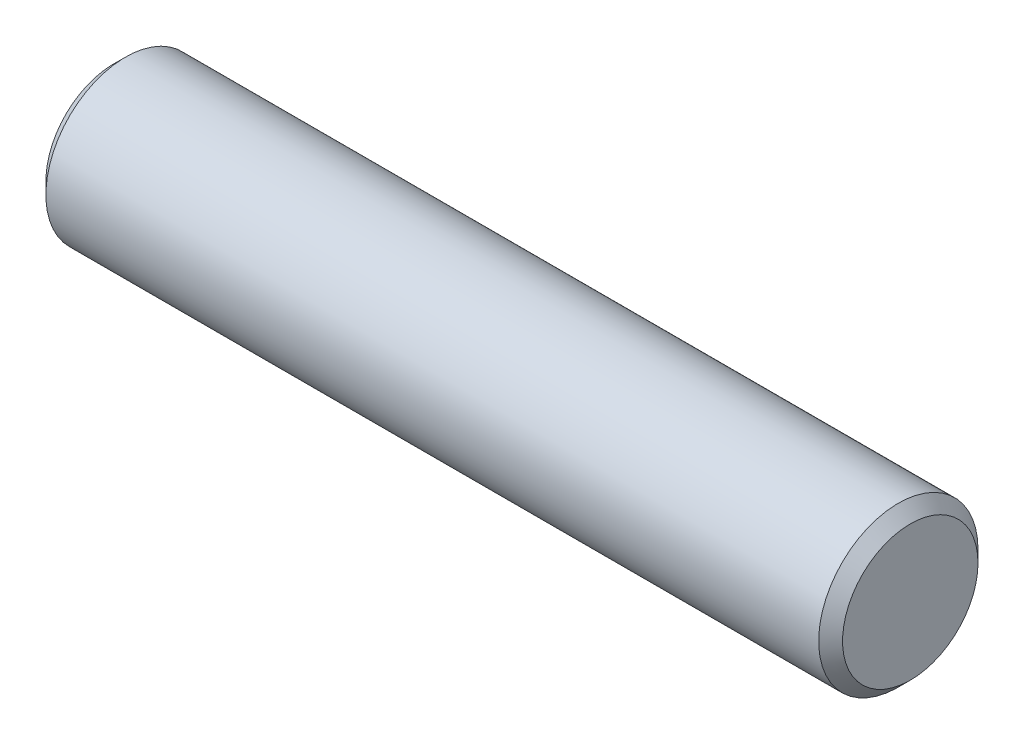
ISO-10303-21;
HEADER;
FILE_DESCRIPTION(('STEP AP214'),'2;1');
FILE_NAME('part.step','',(''),(''),'','','');
FILE_SCHEMA(('AUTOMOTIVE_DESIGN { 1 0 10303 214 1 1 1 1 }'));
ENDSEC;
DATA;
#1=APPLICATION_CONTEXT('core data for automotive mechanical design processes');
#2=APPLICATION_PROTOCOL_DEFINITION('international standard','automotive_design',2000,#1);
#3=PRODUCT_CONTEXT('',#1,'mechanical');
#4=PRODUCT('Part','Part','',(#3));
#5=PRODUCT_RELATED_PRODUCT_CATEGORY('part','',(#4));
#6=PRODUCT_DEFINITION_FORMATION('','',#4);
#7=PRODUCT_DEFINITION_CONTEXT('part definition',#1,'design');
#8=PRODUCT_DEFINITION('design','',#6,#7);
#9=PRODUCT_DEFINITION_SHAPE('','',#8);
#10=(LENGTH_UNIT() NAMED_UNIT(*) SI_UNIT(.MILLI.,.METRE.));
#11=(NAMED_UNIT(*) PLANE_ANGLE_UNIT() SI_UNIT($,.RADIAN.));
#12=(NAMED_UNIT(*) SI_UNIT($,.STERADIAN.) SOLID_ANGLE_UNIT());
#13=UNCERTAINTY_MEASURE_WITH_UNIT(LENGTH_MEASURE(1.E-05),#10,'distance_accuracy_value','');
#14=(GEOMETRIC_REPRESENTATION_CONTEXT(3) GLOBAL_UNCERTAINTY_ASSIGNED_CONTEXT((#13)) GLOBAL_UNIT_ASSIGNED_CONTEXT((#10,
#11,#12)) REPRESENTATION_CONTEXT('',''));
#15=CARTESIAN_POINT('',(0.,0.,0.));
#16=DIRECTION('',(0.,0.,1.));
#17=DIRECTION('',(1.,0.,0.));
#18=AXIS2_PLACEMENT_3D('',#15,#16,#17);
#19=CARTESIAN_POINT('',(0.,10.,0.));
#20=DIRECTION('',(1.,0.,0.));
#21=DIRECTION('',(0.,0.,-1.));
#22=AXIS2_PLACEMENT_3D('',#19,#20,#21);
#23=PLANE('',#22);
#24=CARTESIAN_POINT('',(0.,0.,0.));
#25=DIRECTION('',(1.,0.,0.));
#26=DIRECTION('',(0.,0.,-1.));
#27=AXIS2_PLACEMENT_3D('',#24,#25,#26);
#28=CIRCLE('',#27,8.49999999999998);
#29=CARTESIAN_POINT('',(0.,0.,-8.49999999999998));
#30=VERTEX_POINT('',#29);
#31=EDGE_CURVE('E46',#30,#30,#28,.F.);
#32=ORIENTED_EDGE('',*,*,#31,.T.);
#33=EDGE_LOOP('',(#32));
#34=FACE_BOUND('',#33,.T.);
#35=ADVANCED_FACE('F31',(#34),#23,.F.);
#36=CARTESIAN_POINT('',(-3.175,0.,0.));
#37=DIRECTION('',(-1.,0.,0.));
#38=DIRECTION('',(0.,0.,1.));
#39=AXIS2_PLACEMENT_3D('',#36,#37,#38);
#40=CYLINDRICAL_SURFACE('',#39,10.);
#41=CARTESIAN_POINT('',(1.50000000000006,0.,0.));
#42=DIRECTION('',(1.,0.,0.));
#43=DIRECTION('',(0.,0.,-1.));
#44=AXIS2_PLACEMENT_3D('',#41,#42,#43);
#45=CIRCLE('',#44,10.);
#46=CARTESIAN_POINT('',(1.50000000000006,0.,-10.));
#47=VERTEX_POINT('',#46);
#48=EDGE_CURVE('E38',#47,#47,#45,.T.);
#49=ORIENTED_EDGE('',*,*,#48,.T.);
#50=EDGE_LOOP('',(#49));
#51=FACE_BOUND('',#50,.T.);
#52=CARTESIAN_POINT('',(98.5,0.,0.));
#53=DIRECTION('',(1.,0.,0.));
#54=DIRECTION('',(0.,0.,-1.));
#55=AXIS2_PLACEMENT_3D('',#52,#53,#54);
#56=CIRCLE('',#55,10.);
#57=CARTESIAN_POINT('',(98.5,0.,-10.));
#58=VERTEX_POINT('',#57);
#59=EDGE_CURVE('E42',#58,#58,#56,.F.);
#60=ORIENTED_EDGE('',*,*,#59,.T.);
#61=EDGE_LOOP('',(#60));
#62=FACE_BOUND('',#61,.T.);
#63=ADVANCED_FACE('F62',(#51,#62),#40,.T.);
#64=CARTESIAN_POINT('',(100.,10.,0.));
#65=DIRECTION('',(1.,0.,0.));
#66=DIRECTION('',(0.,0.,-1.));
#67=AXIS2_PLACEMENT_3D('',#64,#65,#66);
#68=PLANE('',#67);
#69=CARTESIAN_POINT('',(100.,0.,0.));
#70=DIRECTION('',(1.,0.,0.));
#71=DIRECTION('',(0.,0.,-1.));
#72=AXIS2_PLACEMENT_3D('',#69,#70,#71);
#73=CIRCLE('',#72,8.5);
#74=CARTESIAN_POINT('',(100.,0.,-8.5));
#75=VERTEX_POINT('',#74);
#76=EDGE_CURVE('E11',#75,#75,#73,.T.);
#77=ORIENTED_EDGE('',*,*,#76,.T.);
#78=EDGE_LOOP('',(#77));
#79=FACE_BOUND('',#78,.T.);
#80=ADVANCED_FACE('F55',(#79),#68,.T.);
#81=CARTESIAN_POINT('',(0.,0.,0.));
#82=DIRECTION('',(1.,0.,0.));
#83=DIRECTION('',(0.,0.,-1.));
#84=AXIS2_PLACEMENT_3D('',#81,#82,#83);
#85=CONICAL_SURFACE('',#84,8.49999999999998,0.785398163397447);
#86=ORIENTED_EDGE('',*,*,#48,.F.);
#87=EDGE_LOOP('',(#86));
#88=FACE_BOUND('',#87,.T.);
#89=ORIENTED_EDGE('',*,*,#31,.F.);
#90=EDGE_LOOP('',(#89));
#91=FACE_BOUND('',#90,.T.);
#92=ADVANCED_FACE('F53',(#88,#91),#85,.T.);
#93=CARTESIAN_POINT('',(98.5,0.,0.));
#94=DIRECTION('',(-1.,0.,0.));
#95=DIRECTION('',(0.,0.,1.));
#96=AXIS2_PLACEMENT_3D('',#93,#94,#95);
#97=CONICAL_SURFACE('',#96,10.,0.785398163397449);
#98=ORIENTED_EDGE('',*,*,#76,.F.);
#99=EDGE_LOOP('',(#98));
#100=FACE_BOUND('',#99,.T.);
#101=ORIENTED_EDGE('',*,*,#59,.F.);
#102=EDGE_LOOP('',(#101));
#103=FACE_BOUND('',#102,.T.);
#104=ADVANCED_FACE('F33',(#100,#103),#97,.T.);
#105=CLOSED_SHELL('',(#35,#63,#80,#92,#104));
#106=MANIFOLD_SOLID_BREP('B2',#105);
#107=ADVANCED_BREP_SHAPE_REPRESENTATION('',(#18,#106),#14);
#108=SHAPE_DEFINITION_REPRESENTATION(#9,#107);
ENDSEC;
END-ISO-10303-21;
